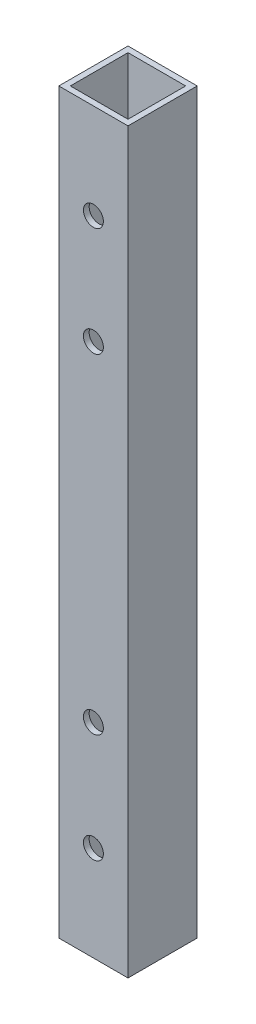
ISO-10303-21;
HEADER;
FILE_DESCRIPTION(('STEP AP214'),'2;1');
FILE_NAME('part.step','',(''),(''),'','','');
FILE_SCHEMA(('AUTOMOTIVE_DESIGN { 1 0 10303 214 1 1 1 1 }'));
ENDSEC;
DATA;
#1=APPLICATION_CONTEXT('core data for automotive mechanical design processes');
#2=APPLICATION_PROTOCOL_DEFINITION('international standard','automotive_design',2000,#1);
#3=PRODUCT_CONTEXT('',#1,'mechanical');
#4=PRODUCT('Part','Part','',(#3));
#5=PRODUCT_RELATED_PRODUCT_CATEGORY('part','',(#4));
#6=PRODUCT_DEFINITION_FORMATION('','',#4);
#7=PRODUCT_DEFINITION_CONTEXT('part definition',#1,'design');
#8=PRODUCT_DEFINITION('design','',#6,#7);
#9=PRODUCT_DEFINITION_SHAPE('','',#8);
#10=(LENGTH_UNIT() NAMED_UNIT(*) SI_UNIT(.MILLI.,.METRE.));
#11=(NAMED_UNIT(*) PLANE_ANGLE_UNIT() SI_UNIT($,.RADIAN.));
#12=(NAMED_UNIT(*) SI_UNIT($,.STERADIAN.) SOLID_ANGLE_UNIT());
#13=UNCERTAINTY_MEASURE_WITH_UNIT(LENGTH_MEASURE(1.E-05),#10,'distance_accuracy_value','');
#14=(GEOMETRIC_REPRESENTATION_CONTEXT(3) GLOBAL_UNCERTAINTY_ASSIGNED_CONTEXT((#13)) GLOBAL_UNIT_ASSIGNED_CONTEXT((#10,
#11,#12)) REPRESENTATION_CONTEXT('',''));
#15=CARTESIAN_POINT('',(0.,0.,0.));
#16=DIRECTION('',(0.,0.,1.));
#17=DIRECTION('',(1.,0.,0.));
#18=AXIS2_PLACEMENT_3D('',#15,#16,#17);
#19=CARTESIAN_POINT('',(1.5875,914.4,-17.4625));
#20=DIRECTION('',(0.,0.,1.));
#21=DIRECTION('',(1.,0.,0.));
#22=AXIS2_PLACEMENT_3D('',#19,#20,#21);
#23=PLANE('',#22);
#24=CARTESIAN_POINT('',(9.51999999999998,735.8,-17.4625));
#25=DIRECTION('',(0.,0.,1.));
#26=DIRECTION('',(1.,0.,0.));
#27=AXIS2_PLACEMENT_3D('',#24,#25,#26);
#28=CIRCLE('',#27,2.74999999999998);
#29=CARTESIAN_POINT('',(12.27,735.8,-17.4625));
#30=VERTEX_POINT('',#29);
#31=EDGE_CURVE('E204',#30,#30,#28,.T.);
#32=ORIENTED_EDGE('',*,*,#31,.F.);
#33=EDGE_LOOP('',(#32));
#34=FACE_BOUND('',#33,.T.);
#35=CARTESIAN_POINT('',(9.51999999999999,615.,-17.4625));
#36=DIRECTION('',(0.,0.,1.));
#37=DIRECTION('',(1.,0.,0.));
#38=AXIS2_PLACEMENT_3D('',#35,#36,#37);
#39=CIRCLE('',#38,2.74999999999998);
#40=CARTESIAN_POINT('',(12.27,615.,-17.4625));
#41=VERTEX_POINT('',#40);
#42=EDGE_CURVE('E215',#41,#41,#39,.T.);
#43=ORIENTED_EDGE('',*,*,#42,.F.);
#44=EDGE_LOOP('',(#43));
#45=FACE_BOUND('',#44,.T.);
#46=CARTESIAN_POINT('',(9.51999999999998,585.,-17.4625));
#47=DIRECTION('',(0.,0.,1.));
#48=DIRECTION('',(1.,0.,0.));
#49=AXIS2_PLACEMENT_3D('',#46,#47,#48);
#50=CIRCLE('',#49,2.74999999999998);
#51=CARTESIAN_POINT('',(12.27,585.,-17.4625));
#52=VERTEX_POINT('',#51);
#53=EDGE_CURVE('E223',#52,#52,#50,.T.);
#54=ORIENTED_EDGE('',*,*,#53,.F.);
#55=EDGE_LOOP('',(#54));
#56=FACE_BOUND('',#55,.T.);
#57=CARTESIAN_POINT('',(9.51999999999999,705.8,-17.4625));
#58=DIRECTION('',(0.,0.,1.));
#59=DIRECTION('',(1.,0.,0.));
#60=AXIS2_PLACEMENT_3D('',#57,#58,#59);
#61=CIRCLE('',#60,2.74999999999998);
#62=CARTESIAN_POINT('',(12.27,705.8,-17.4625));
#63=VERTEX_POINT('',#62);
#64=EDGE_CURVE('E231',#63,#63,#61,.T.);
#65=ORIENTED_EDGE('',*,*,#64,.F.);
#66=EDGE_LOOP('',(#65));
#67=FACE_BOUND('',#66,.T.);
#68=DIRECTION('',(0.,-1.,0.));
#69=VECTOR('',#68,1.);
#70=CARTESIAN_POINT('',(17.4625,914.4,-17.4625));
#71=LINE('',#70,#69);
#72=CARTESIAN_POINT('',(17.4625,762.,-17.4625));
#73=VERTEX_POINT('',#72);
#74=CARTESIAN_POINT('',(17.4625,558.8,-17.4625));
#75=VERTEX_POINT('',#74);
#76=EDGE_CURVE('E154',#73,#75,#71,.T.);
#77=ORIENTED_EDGE('',*,*,#76,.F.);
#78=DIRECTION('',(-1.,0.,0.));
#79=VECTOR('',#78,1.);
#80=CARTESIAN_POINT('',(1.5875,762.,-17.4625));
#81=LINE('',#80,#79);
#82=CARTESIAN_POINT('',(1.5875,762.,-17.4625));
#83=VERTEX_POINT('',#82);
#84=EDGE_CURVE('E12',#73,#83,#81,.T.);
#85=ORIENTED_EDGE('',*,*,#84,.T.);
#86=DIRECTION('',(0.,-1.,0.));
#87=VECTOR('',#86,1.);
#88=CARTESIAN_POINT('',(1.5875,914.4,-17.4625));
#89=LINE('',#88,#87);
#90=CARTESIAN_POINT('',(1.5875,558.8,-17.4625));
#91=VERTEX_POINT('',#90);
#92=EDGE_CURVE('E156',#83,#91,#89,.T.);
#93=ORIENTED_EDGE('',*,*,#92,.T.);
#94=DIRECTION('',(1.,0.,0.));
#95=VECTOR('',#94,1.);
#96=CARTESIAN_POINT('',(1.5875,558.8,-17.4625));
#97=LINE('',#96,#95);
#98=EDGE_CURVE('E55',#91,#75,#97,.T.);
#99=ORIENTED_EDGE('',*,*,#98,.T.);
#100=EDGE_LOOP('',(#77,#85,#93,#99));
#101=FACE_BOUND('',#100,.T.);
#102=ADVANCED_FACE('F46',(#34,#45,#56,#67,#101),#23,.T.);
#103=CARTESIAN_POINT('',(17.4625,914.4,-1.5875));
#104=DIRECTION('',(-1.,0.,0.));
#105=DIRECTION('',(0.,0.,1.));
#106=AXIS2_PLACEMENT_3D('',#103,#104,#105);
#107=PLANE('',#106);
#108=DIRECTION('',(0.,-1.,0.));
#109=VECTOR('',#108,1.);
#110=CARTESIAN_POINT('',(17.4625,914.4,-1.5875));
#111=LINE('',#110,#109);
#112=CARTESIAN_POINT('',(17.4625,762.,-1.5875));
#113=VERTEX_POINT('',#112);
#114=CARTESIAN_POINT('',(17.4625,558.8,-1.5875));
#115=VERTEX_POINT('',#114);
#116=EDGE_CURVE('E140',#113,#115,#111,.T.);
#117=ORIENTED_EDGE('',*,*,#116,.F.);
#118=DIRECTION('',(0.,0.,-1.));
#119=VECTOR('',#118,1.);
#120=CARTESIAN_POINT('',(17.4625,762.,-1.5875));
#121=LINE('',#120,#119);
#122=EDGE_CURVE('E165',#113,#73,#121,.T.);
#123=ORIENTED_EDGE('',*,*,#122,.T.);
#124=ORIENTED_EDGE('',*,*,#76,.T.);
#125=DIRECTION('',(0.,0.,1.));
#126=VECTOR('',#125,1.);
#127=CARTESIAN_POINT('',(17.4625,558.8,-1.5875));
#128=LINE('',#127,#126);
#129=EDGE_CURVE('E128',#75,#115,#128,.T.);
#130=ORIENTED_EDGE('',*,*,#129,.T.);
#131=EDGE_LOOP('',(#117,#123,#124,#130));
#132=FACE_BOUND('',#131,.T.);
#133=ADVANCED_FACE('F163',(#132),#107,.T.);
#134=CARTESIAN_POINT('',(1.5875,914.4,-1.5875));
#135=DIRECTION('',(0.,0.,-1.));
#136=DIRECTION('',(-1.,0.,0.));
#137=AXIS2_PLACEMENT_3D('',#134,#135,#136);
#138=PLANE('',#137);
#139=CARTESIAN_POINT('',(9.51999999999998,735.8,-1.5875));
#140=DIRECTION('',(0.,0.,-1.));
#141=DIRECTION('',(-1.,0.,0.));
#142=AXIS2_PLACEMENT_3D('',#139,#140,#141);
#143=CIRCLE('',#142,2.74999999999998);
#144=CARTESIAN_POINT('',(6.77,735.8,-1.5875));
#145=VERTEX_POINT('',#144);
#146=EDGE_CURVE('E211',#145,#145,#143,.T.);
#147=ORIENTED_EDGE('',*,*,#146,.F.);
#148=EDGE_LOOP('',(#147));
#149=FACE_BOUND('',#148,.T.);
#150=CARTESIAN_POINT('',(9.51999999999999,615.,-1.5875));
#151=DIRECTION('',(0.,0.,-1.));
#152=DIRECTION('',(-1.,0.,0.));
#153=AXIS2_PLACEMENT_3D('',#150,#151,#152);
#154=CIRCLE('',#153,2.74999999999998);
#155=CARTESIAN_POINT('',(6.77,615.,-1.5875));
#156=VERTEX_POINT('',#155);
#157=EDGE_CURVE('E219',#156,#156,#154,.T.);
#158=ORIENTED_EDGE('',*,*,#157,.F.);
#159=EDGE_LOOP('',(#158));
#160=FACE_BOUND('',#159,.T.);
#161=CARTESIAN_POINT('',(9.51999999999998,585.,-1.5875));
#162=DIRECTION('',(0.,0.,-1.));
#163=DIRECTION('',(-1.,0.,0.));
#164=AXIS2_PLACEMENT_3D('',#161,#162,#163);
#165=CIRCLE('',#164,2.74999999999998);
#166=CARTESIAN_POINT('',(6.77,585.,-1.5875));
#167=VERTEX_POINT('',#166);
#168=EDGE_CURVE('E227',#167,#167,#165,.T.);
#169=ORIENTED_EDGE('',*,*,#168,.F.);
#170=EDGE_LOOP('',(#169));
#171=FACE_BOUND('',#170,.T.);
#172=CARTESIAN_POINT('',(9.51999999999999,705.8,-1.5875));
#173=DIRECTION('',(0.,0.,-1.));
#174=DIRECTION('',(-1.,0.,0.));
#175=AXIS2_PLACEMENT_3D('',#172,#173,#174);
#176=CIRCLE('',#175,2.74999999999998);
#177=CARTESIAN_POINT('',(6.77,705.8,-1.5875));
#178=VERTEX_POINT('',#177);
#179=EDGE_CURVE('E235',#178,#178,#176,.T.);
#180=ORIENTED_EDGE('',*,*,#179,.F.);
#181=EDGE_LOOP('',(#180));
#182=FACE_BOUND('',#181,.T.);
#183=DIRECTION('',(0.,-1.,0.));
#184=VECTOR('',#183,1.);
#185=CARTESIAN_POINT('',(1.5875,914.4,-1.5875));
#186=LINE('',#185,#184);
#187=CARTESIAN_POINT('',(1.5875,762.,-1.5875));
#188=VERTEX_POINT('',#187);
#189=CARTESIAN_POINT('',(1.5875,558.8,-1.5875));
#190=VERTEX_POINT('',#189);
#191=EDGE_CURVE('E133',#188,#190,#186,.T.);
#192=ORIENTED_EDGE('',*,*,#191,.F.);
#193=DIRECTION('',(1.,0.,0.));
#194=VECTOR('',#193,1.);
#195=CARTESIAN_POINT('',(1.5875,762.,-1.5875));
#196=LINE('',#195,#194);
#197=EDGE_CURVE('E176',#188,#113,#196,.T.);
#198=ORIENTED_EDGE('',*,*,#197,.T.);
#199=ORIENTED_EDGE('',*,*,#116,.T.);
#200=DIRECTION('',(-1.,0.,0.));
#201=VECTOR('',#200,1.);
#202=CARTESIAN_POINT('',(1.5875,558.8,-1.5875));
#203=LINE('',#202,#201);
#204=EDGE_CURVE('E185',#115,#190,#203,.T.);
#205=ORIENTED_EDGE('',*,*,#204,.T.);
#206=EDGE_LOOP('',(#192,#198,#199,#205));
#207=FACE_BOUND('',#206,.T.);
#208=ADVANCED_FACE('F301',(#149,#160,#171,#182,#207),#138,.T.);
#209=CARTESIAN_POINT('',(1.5875,914.4,-1.5875));
#210=DIRECTION('',(1.,0.,0.));
#211=DIRECTION('',(0.,0.,-1.));
#212=AXIS2_PLACEMENT_3D('',#209,#210,#211);
#213=PLANE('',#212);
#214=ORIENTED_EDGE('',*,*,#92,.F.);
#215=DIRECTION('',(0.,0.,1.));
#216=VECTOR('',#215,1.);
#217=CARTESIAN_POINT('',(1.5875,762.,-1.5875));
#218=LINE('',#217,#216);
#219=EDGE_CURVE('E170',#83,#188,#218,.T.);
#220=ORIENTED_EDGE('',*,*,#219,.T.);
#221=ORIENTED_EDGE('',*,*,#191,.T.);
#222=DIRECTION('',(0.,0.,-1.));
#223=VECTOR('',#222,1.);
#224=CARTESIAN_POINT('',(1.5875,558.8,-1.5875));
#225=LINE('',#224,#223);
#226=EDGE_CURVE('E182',#190,#91,#225,.T.);
#227=ORIENTED_EDGE('',*,*,#226,.T.);
#228=EDGE_LOOP('',(#214,#220,#221,#227));
#229=FACE_BOUND('',#228,.T.);
#230=ADVANCED_FACE('F311',(#229),#213,.T.);
#231=CARTESIAN_POINT('',(0.,558.8,-19.05));
#232=DIRECTION('',(0.,-1.,0.));
#233=DIRECTION('',(0.,0.,-1.));
#234=AXIS2_PLACEMENT_3D('',#231,#232,#233);
#235=PLANE('',#234);
#236=ORIENTED_EDGE('',*,*,#204,.F.);
#237=ORIENTED_EDGE('',*,*,#129,.F.);
#238=ORIENTED_EDGE('',*,*,#98,.F.);
#239=ORIENTED_EDGE('',*,*,#226,.F.);
#240=EDGE_LOOP('',(#236,#237,#238,#239));
#241=FACE_BOUND('',#240,.T.);
#242=DIRECTION('',(1.,0.,0.));
#243=VECTOR('',#242,1.);
#244=CARTESIAN_POINT('',(0.,558.8,0.));
#245=LINE('',#244,#243);
#246=CARTESIAN_POINT('',(0.,558.8,0.));
#247=VERTEX_POINT('',#246);
#248=CARTESIAN_POINT('',(19.05,558.8,0.));
#249=VERTEX_POINT('',#248);
#250=EDGE_CURVE('E201',#247,#249,#245,.T.);
#251=ORIENTED_EDGE('',*,*,#250,.F.);
#252=DIRECTION('',(0.,0.,1.));
#253=VECTOR('',#252,1.);
#254=CARTESIAN_POINT('',(0.,558.8,-19.05));
#255=LINE('',#254,#253);
#256=CARTESIAN_POINT('',(0.,558.8,-19.05));
#257=VERTEX_POINT('',#256);
#258=EDGE_CURVE('E70',#257,#247,#255,.T.);
#259=ORIENTED_EDGE('',*,*,#258,.F.);
#260=DIRECTION('',(1.,0.,0.));
#261=VECTOR('',#260,1.);
#262=CARTESIAN_POINT('',(0.,558.8,-19.05));
#263=LINE('',#262,#261);
#264=CARTESIAN_POINT('',(19.05,558.8,-19.05));
#265=VERTEX_POINT('',#264);
#266=EDGE_CURVE('E119',#257,#265,#263,.T.);
#267=ORIENTED_EDGE('',*,*,#266,.T.);
#268=DIRECTION('',(0.,0.,1.));
#269=VECTOR('',#268,1.);
#270=CARTESIAN_POINT('',(19.05,558.8,-19.05));
#271=LINE('',#270,#269);
#272=EDGE_CURVE('E193',#265,#249,#271,.T.);
#273=ORIENTED_EDGE('',*,*,#272,.T.);
#274=EDGE_LOOP('',(#251,#259,#267,#273));
#275=FACE_BOUND('',#274,.T.);
#276=ADVANCED_FACE('F306',(#241,#275),#235,.T.);
#277=CARTESIAN_POINT('',(0.,762.,-19.05));
#278=DIRECTION('',(0.,1.,0.));
#279=DIRECTION('',(0.,0.,1.));
#280=AXIS2_PLACEMENT_3D('',#277,#278,#279);
#281=PLANE('',#280);
#282=ORIENTED_EDGE('',*,*,#84,.F.);
#283=ORIENTED_EDGE('',*,*,#122,.F.);
#284=ORIENTED_EDGE('',*,*,#197,.F.);
#285=ORIENTED_EDGE('',*,*,#219,.F.);
#286=EDGE_LOOP('',(#282,#283,#284,#285));
#287=FACE_BOUND('',#286,.T.);
#288=DIRECTION('',(-1.,0.,0.));
#289=VECTOR('',#288,1.);
#290=CARTESIAN_POINT('',(0.,762.,0.));
#291=LINE('',#290,#289);
#292=CARTESIAN_POINT('',(19.05,762.,0.));
#293=VERTEX_POINT('',#292);
#294=CARTESIAN_POINT('',(0.,762.,0.));
#295=VERTEX_POINT('',#294);
#296=EDGE_CURVE('E198',#293,#295,#291,.T.);
#297=ORIENTED_EDGE('',*,*,#296,.F.);
#298=DIRECTION('',(0.,0.,1.));
#299=VECTOR('',#298,1.);
#300=CARTESIAN_POINT('',(19.05,762.,-19.05));
#301=LINE('',#300,#299);
#302=CARTESIAN_POINT('',(19.05,762.,-19.05));
#303=VERTEX_POINT('',#302);
#304=EDGE_CURVE('E62',#303,#293,#301,.T.);
#305=ORIENTED_EDGE('',*,*,#304,.F.);
#306=DIRECTION('',(-1.,0.,0.));
#307=VECTOR('',#306,1.);
#308=CARTESIAN_POINT('',(0.,762.,-19.05));
#309=LINE('',#308,#307);
#310=CARTESIAN_POINT('',(0.,762.,-19.05));
#311=VERTEX_POINT('',#310);
#312=EDGE_CURVE('E109',#303,#311,#309,.T.);
#313=ORIENTED_EDGE('',*,*,#312,.T.);
#314=DIRECTION('',(0.,0.,1.));
#315=VECTOR('',#314,1.);
#316=CARTESIAN_POINT('',(0.,762.,-19.05));
#317=LINE('',#316,#315);
#318=EDGE_CURVE('E112',#311,#295,#317,.T.);
#319=ORIENTED_EDGE('',*,*,#318,.T.);
#320=EDGE_LOOP('',(#297,#305,#313,#319));
#321=FACE_BOUND('',#320,.T.);
#322=ADVANCED_FACE('F111',(#287,#321),#281,.T.);
#323=CARTESIAN_POINT('',(0.,914.4,0.));
#324=DIRECTION('',(1.,0.,0.));
#325=DIRECTION('',(0.,0.,-1.));
#326=AXIS2_PLACEMENT_3D('',#323,#324,#325);
#327=PLANE('',#326);
#328=ORIENTED_EDGE('',*,*,#318,.F.);
#329=DIRECTION('',(0.,-1.,0.));
#330=VECTOR('',#329,1.);
#331=CARTESIAN_POINT('',(0.,914.4,-19.05));
#332=LINE('',#331,#330);
#333=EDGE_CURVE('E124',#311,#257,#332,.T.);
#334=ORIENTED_EDGE('',*,*,#333,.T.);
#335=ORIENTED_EDGE('',*,*,#258,.T.);
#336=DIRECTION('',(0.,-1.,0.));
#337=VECTOR('',#336,1.);
#338=CARTESIAN_POINT('',(0.,914.4,0.));
#339=LINE('',#338,#337);
#340=EDGE_CURVE('E126',#295,#247,#339,.T.);
#341=ORIENTED_EDGE('',*,*,#340,.F.);
#342=EDGE_LOOP('',(#328,#334,#335,#341));
#343=FACE_BOUND('',#342,.T.);
#344=ADVANCED_FACE('F48',(#343),#327,.F.);
#345=CARTESIAN_POINT('',(0.,914.4,0.));
#346=DIRECTION('',(0.,0.,-1.));
#347=DIRECTION('',(-1.,0.,0.));
#348=AXIS2_PLACEMENT_3D('',#345,#346,#347);
#349=PLANE('',#348);
#350=CARTESIAN_POINT('',(9.51999999999998,735.8,0.));
#351=DIRECTION('',(0.,0.,1.));
#352=DIRECTION('',(1.,0.,0.));
#353=AXIS2_PLACEMENT_3D('',#350,#351,#352);
#354=CIRCLE('',#353,2.74999999999998);
#355=CARTESIAN_POINT('',(12.27,735.8,0.));
#356=VERTEX_POINT('',#355);
#357=EDGE_CURVE('E257',#356,#356,#354,.T.);
#358=ORIENTED_EDGE('',*,*,#357,.F.);
#359=EDGE_LOOP('',(#358));
#360=FACE_BOUND('',#359,.T.);
#361=CARTESIAN_POINT('',(9.51999999999999,615.,0.));
#362=DIRECTION('',(0.,0.,1.));
#363=DIRECTION('',(-1.,0.,0.));
#364=AXIS2_PLACEMENT_3D('',#361,#362,#363);
#365=CIRCLE('',#364,2.74999999999998);
#366=CARTESIAN_POINT('',(6.77,615.,0.));
#367=VERTEX_POINT('',#366);
#368=EDGE_CURVE('E245',#367,#367,#365,.T.);
#369=ORIENTED_EDGE('',*,*,#368,.F.);
#370=EDGE_LOOP('',(#369));
#371=FACE_BOUND('',#370,.T.);
#372=CARTESIAN_POINT('',(9.51999999999998,585.,0.));
#373=DIRECTION('',(0.,0.,1.));
#374=DIRECTION('',(-1.,0.,0.));
#375=AXIS2_PLACEMENT_3D('',#372,#373,#374);
#376=CIRCLE('',#375,2.74999999999998);
#377=CARTESIAN_POINT('',(6.77,585.,0.));
#378=VERTEX_POINT('',#377);
#379=EDGE_CURVE('E244',#378,#378,#376,.T.);
#380=ORIENTED_EDGE('',*,*,#379,.F.);
#381=EDGE_LOOP('',(#380));
#382=FACE_BOUND('',#381,.T.);
#383=CARTESIAN_POINT('',(9.51999999999999,705.8,0.));
#384=DIRECTION('',(0.,0.,1.));
#385=DIRECTION('',(1.,0.,0.));
#386=AXIS2_PLACEMENT_3D('',#383,#384,#385);
#387=CIRCLE('',#386,2.74999999999998);
#388=CARTESIAN_POINT('',(12.27,705.8,0.));
#389=VERTEX_POINT('',#388);
#390=EDGE_CURVE('E253',#389,#389,#387,.T.);
#391=ORIENTED_EDGE('',*,*,#390,.F.);
#392=EDGE_LOOP('',(#391));
#393=FACE_BOUND('',#392,.T.);
#394=ORIENTED_EDGE('',*,*,#296,.T.);
#395=ORIENTED_EDGE('',*,*,#340,.T.);
#396=ORIENTED_EDGE('',*,*,#250,.T.);
#397=DIRECTION('',(0.,-1.,0.));
#398=VECTOR('',#397,1.);
#399=CARTESIAN_POINT('',(19.05,914.4,0.));
#400=LINE('',#399,#398);
#401=EDGE_CURVE('E137',#293,#249,#400,.T.);
#402=ORIENTED_EDGE('',*,*,#401,.F.);
#403=EDGE_LOOP('',(#394,#395,#396,#402));
#404=FACE_BOUND('',#403,.T.);
#405=ADVANCED_FACE('F320',(#360,#371,#382,#393,#404),#349,.F.);
#406=CARTESIAN_POINT('',(19.05,914.4,0.));
#407=DIRECTION('',(-1.,0.,0.));
#408=DIRECTION('',(0.,0.,1.));
#409=AXIS2_PLACEMENT_3D('',#406,#407,#408);
#410=PLANE('',#409);
#411=ORIENTED_EDGE('',*,*,#304,.T.);
#412=ORIENTED_EDGE('',*,*,#401,.T.);
#413=ORIENTED_EDGE('',*,*,#272,.F.);
#414=DIRECTION('',(0.,-1.,0.));
#415=VECTOR('',#414,1.);
#416=CARTESIAN_POINT('',(19.05,914.4,-19.05));
#417=LINE('',#416,#415);
#418=EDGE_CURVE('E132',#303,#265,#417,.T.);
#419=ORIENTED_EDGE('',*,*,#418,.F.);
#420=EDGE_LOOP('',(#411,#412,#413,#419));
#421=FACE_BOUND('',#420,.T.);
#422=ADVANCED_FACE('F318',(#421),#410,.F.);
#423=CARTESIAN_POINT('',(0.,914.4,-19.05));
#424=DIRECTION('',(0.,0.,1.));
#425=DIRECTION('',(1.,0.,0.));
#426=AXIS2_PLACEMENT_3D('',#423,#424,#425);
#427=PLANE('',#426);
#428=CARTESIAN_POINT('',(9.51999999999998,735.8,-19.05));
#429=DIRECTION('',(0.,0.,1.));
#430=DIRECTION('',(1.,0.,0.));
#431=AXIS2_PLACEMENT_3D('',#428,#429,#430);
#432=CIRCLE('',#431,2.74999999999998);
#433=CARTESIAN_POINT('',(12.27,735.8,-19.05));
#434=VERTEX_POINT('',#433);
#435=EDGE_CURVE('E239',#434,#434,#432,.T.);
#436=ORIENTED_EDGE('',*,*,#435,.T.);
#437=EDGE_LOOP('',(#436));
#438=FACE_BOUND('',#437,.T.);
#439=CARTESIAN_POINT('',(9.51999999999999,615.,-19.05));
#440=DIRECTION('',(0.,0.,1.));
#441=DIRECTION('',(-1.,0.,0.));
#442=AXIS2_PLACEMENT_3D('',#439,#440,#441);
#443=CIRCLE('',#442,2.74999999999998);
#444=CARTESIAN_POINT('',(6.77,615.,-19.05));
#445=VERTEX_POINT('',#444);
#446=EDGE_CURVE('E258',#445,#445,#443,.T.);
#447=ORIENTED_EDGE('',*,*,#446,.T.);
#448=EDGE_LOOP('',(#447));
#449=FACE_BOUND('',#448,.T.);
#450=CARTESIAN_POINT('',(9.51999999999998,585.,-19.05));
#451=DIRECTION('',(0.,0.,1.));
#452=DIRECTION('',(-1.,0.,0.));
#453=AXIS2_PLACEMENT_3D('',#450,#451,#452);
#454=CIRCLE('',#453,2.74999999999998);
#455=CARTESIAN_POINT('',(6.77,585.,-19.05));
#456=VERTEX_POINT('',#455);
#457=EDGE_CURVE('E240',#456,#456,#454,.T.);
#458=ORIENTED_EDGE('',*,*,#457,.T.);
#459=EDGE_LOOP('',(#458));
#460=FACE_BOUND('',#459,.T.);
#461=CARTESIAN_POINT('',(9.51999999999999,705.8,-19.05));
#462=DIRECTION('',(0.,0.,1.));
#463=DIRECTION('',(1.,0.,0.));
#464=AXIS2_PLACEMENT_3D('',#461,#462,#463);
#465=CIRCLE('',#464,2.74999999999998);
#466=CARTESIAN_POINT('',(12.27,705.8,-19.05));
#467=VERTEX_POINT('',#466);
#468=EDGE_CURVE('E249',#467,#467,#465,.T.);
#469=ORIENTED_EDGE('',*,*,#468,.T.);
#470=EDGE_LOOP('',(#469));
#471=FACE_BOUND('',#470,.T.);
#472=ORIENTED_EDGE('',*,*,#312,.F.);
#473=ORIENTED_EDGE('',*,*,#418,.T.);
#474=ORIENTED_EDGE('',*,*,#266,.F.);
#475=ORIENTED_EDGE('',*,*,#333,.F.);
#476=EDGE_LOOP('',(#472,#473,#474,#475));
#477=FACE_BOUND('',#476,.T.);
#478=ADVANCED_FACE('F130',(#438,#449,#460,#471,#477),#427,.F.);
#479=CARTESIAN_POINT('',(9.51999999999999,705.8,-19.05));
#480=DIRECTION('',(0.,0.,1.));
#481=DIRECTION('',(1.,0.,0.));
#482=AXIS2_PLACEMENT_3D('',#479,#480,#481);
#483=CYLINDRICAL_SURFACE('',#482,2.74999999999998);
#484=ORIENTED_EDGE('',*,*,#64,.T.);
#485=EDGE_LOOP('',(#484));
#486=FACE_BOUND('',#485,.T.);
#487=ORIENTED_EDGE('',*,*,#468,.F.);
#488=EDGE_LOOP('',(#487));
#489=FACE_BOUND('',#488,.T.);
#490=ADVANCED_FACE('F288',(#486,#489),#483,.F.);
#491=CARTESIAN_POINT('',(9.51999999999998,585.,-19.05));
#492=DIRECTION('',(0.,0.,1.));
#493=DIRECTION('',(1.,0.,0.));
#494=AXIS2_PLACEMENT_3D('',#491,#492,#493);
#495=CYLINDRICAL_SURFACE('',#494,2.74999999999998);
#496=ORIENTED_EDGE('',*,*,#53,.T.);
#497=EDGE_LOOP('',(#496));
#498=FACE_BOUND('',#497,.T.);
#499=ORIENTED_EDGE('',*,*,#457,.F.);
#500=EDGE_LOOP('',(#499));
#501=FACE_BOUND('',#500,.T.);
#502=ADVANCED_FACE('F289',(#498,#501),#495,.F.);
#503=CARTESIAN_POINT('',(9.51999999999999,615.,-19.05));
#504=DIRECTION('',(0.,0.,1.));
#505=DIRECTION('',(1.,0.,0.));
#506=AXIS2_PLACEMENT_3D('',#503,#504,#505);
#507=CYLINDRICAL_SURFACE('',#506,2.74999999999998);
#508=ORIENTED_EDGE('',*,*,#42,.T.);
#509=EDGE_LOOP('',(#508));
#510=FACE_BOUND('',#509,.T.);
#511=ORIENTED_EDGE('',*,*,#446,.F.);
#512=EDGE_LOOP('',(#511));
#513=FACE_BOUND('',#512,.T.);
#514=ADVANCED_FACE('F277',(#510,#513),#507,.F.);
#515=CARTESIAN_POINT('',(9.51999999999998,735.8,-19.05));
#516=DIRECTION('',(0.,0.,1.));
#517=DIRECTION('',(1.,0.,0.));
#518=AXIS2_PLACEMENT_3D('',#515,#516,#517);
#519=CYLINDRICAL_SURFACE('',#518,2.74999999999998);
#520=ORIENTED_EDGE('',*,*,#31,.T.);
#521=EDGE_LOOP('',(#520));
#522=FACE_BOUND('',#521,.T.);
#523=ORIENTED_EDGE('',*,*,#435,.F.);
#524=EDGE_LOOP('',(#523));
#525=FACE_BOUND('',#524,.T.);
#526=ADVANCED_FACE('F274',(#522,#525),#519,.F.);
#527=ORIENTED_EDGE('',*,*,#179,.T.);
#528=EDGE_LOOP('',(#527));
#529=FACE_BOUND('',#528,.T.);
#530=ORIENTED_EDGE('',*,*,#390,.T.);
#531=EDGE_LOOP('',(#530));
#532=FACE_BOUND('',#531,.T.);
#533=ADVANCED_FACE('F276',(#529,#532),#483,.F.);
#534=ORIENTED_EDGE('',*,*,#168,.T.);
#535=EDGE_LOOP('',(#534));
#536=FACE_BOUND('',#535,.T.);
#537=ORIENTED_EDGE('',*,*,#379,.T.);
#538=EDGE_LOOP('',(#537));
#539=FACE_BOUND('',#538,.T.);
#540=ADVANCED_FACE('F285',(#536,#539),#495,.F.);
#541=ORIENTED_EDGE('',*,*,#157,.T.);
#542=EDGE_LOOP('',(#541));
#543=FACE_BOUND('',#542,.T.);
#544=ORIENTED_EDGE('',*,*,#368,.T.);
#545=EDGE_LOOP('',(#544));
#546=FACE_BOUND('',#545,.T.);
#547=ADVANCED_FACE('F292',(#543,#546),#507,.F.);
#548=ORIENTED_EDGE('',*,*,#146,.T.);
#549=EDGE_LOOP('',(#548));
#550=FACE_BOUND('',#549,.T.);
#551=ORIENTED_EDGE('',*,*,#357,.T.);
#552=EDGE_LOOP('',(#551));
#553=FACE_BOUND('',#552,.T.);
#554=ADVANCED_FACE('F280',(#550,#553),#519,.F.);
#555=CLOSED_SHELL('',(#102,#133,#208,#230,#276,#322,#344,#405,#422,#478,#490,#502,#514,#526,
#533,#540,#547,#554));
#556=MANIFOLD_SOLID_BREP('B2',#555);
#557=ADVANCED_BREP_SHAPE_REPRESENTATION('',(#18,#556),#14);
#558=SHAPE_DEFINITION_REPRESENTATION(#9,#557);
ENDSEC;
END-ISO-10303-21;
